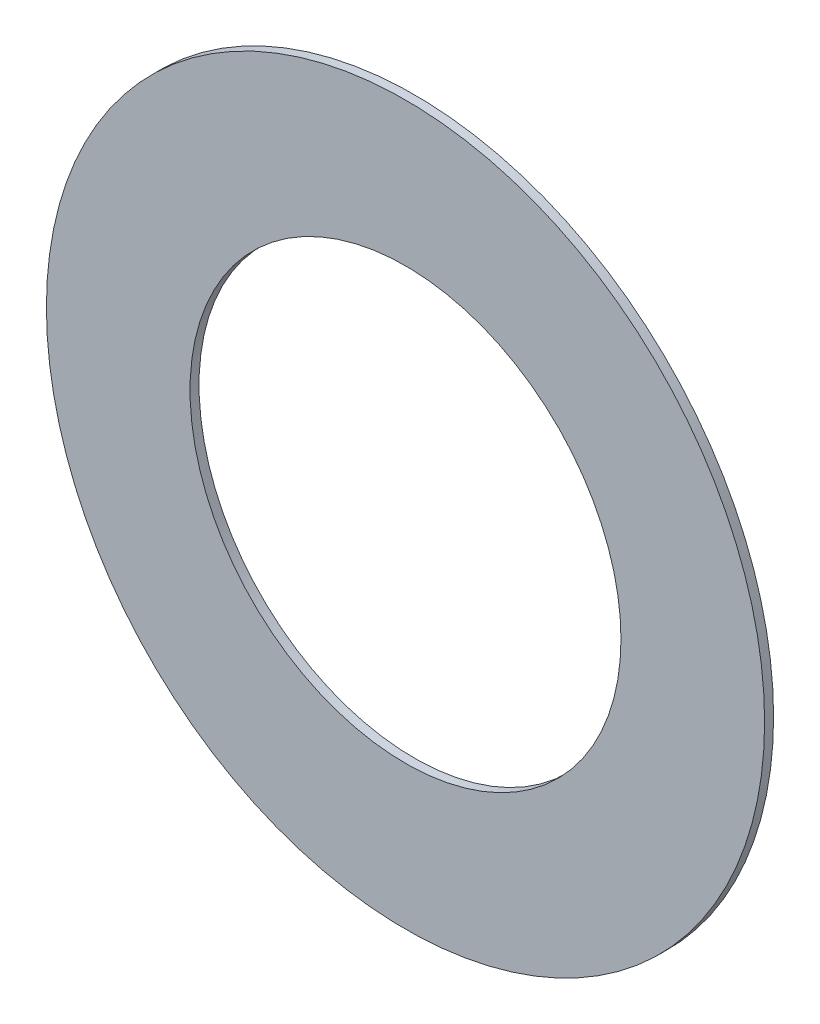
ISO-10303-21;
HEADER;
FILE_DESCRIPTION(('STEP AP214'),'2;1');
FILE_NAME('part.step','',(''),(''),'','','');
FILE_SCHEMA(('AUTOMOTIVE_DESIGN { 1 0 10303 214 1 1 1 1 }'));
ENDSEC;
DATA;
#1=APPLICATION_CONTEXT('core data for automotive mechanical design processes');
#2=APPLICATION_PROTOCOL_DEFINITION('international standard','automotive_design',2000,#1);
#3=PRODUCT_CONTEXT('',#1,'mechanical');
#4=PRODUCT('Part','Part','',(#3));
#5=PRODUCT_RELATED_PRODUCT_CATEGORY('part','',(#4));
#6=PRODUCT_DEFINITION_FORMATION('','',#4);
#7=PRODUCT_DEFINITION_CONTEXT('part definition',#1,'design');
#8=PRODUCT_DEFINITION('design','',#6,#7);
#9=PRODUCT_DEFINITION_SHAPE('','',#8);
#10=(LENGTH_UNIT() NAMED_UNIT(*) SI_UNIT(.MILLI.,.METRE.));
#11=(NAMED_UNIT(*) PLANE_ANGLE_UNIT() SI_UNIT($,.RADIAN.));
#12=(NAMED_UNIT(*) SI_UNIT($,.STERADIAN.) SOLID_ANGLE_UNIT());
#13=UNCERTAINTY_MEASURE_WITH_UNIT(LENGTH_MEASURE(1.E-05),#10,'distance_accuracy_value','');
#14=(GEOMETRIC_REPRESENTATION_CONTEXT(3) GLOBAL_UNCERTAINTY_ASSIGNED_CONTEXT((#13)) GLOBAL_UNIT_ASSIGNED_CONTEXT((#10,
#11,#12)) REPRESENTATION_CONTEXT('',''));
#15=CARTESIAN_POINT('',(0.,0.,0.));
#16=DIRECTION('',(0.,0.,1.));
#17=DIRECTION('',(1.,0.,0.));
#18=AXIS2_PLACEMENT_3D('',#15,#16,#17);
#19=CARTESIAN_POINT('',(0.,0.,3.175));
#20=DIRECTION('',(0.,0.,1.));
#21=DIRECTION('',(1.,0.,0.));
#22=AXIS2_PLACEMENT_3D('',#19,#20,#21);
#23=PLANE('',#22);
#24=CARTESIAN_POINT('',(0.,0.,3.175));
#25=DIRECTION('',(0.,0.,1.));
#26=DIRECTION('',(1.,0.,0.));
#27=AXIS2_PLACEMENT_3D('',#24,#25,#26);
#28=CIRCLE('',#27,127.);
#29=CARTESIAN_POINT('',(127.,0.,3.175));
#30=VERTEX_POINT('',#29);
#31=EDGE_CURVE('E10',#30,#30,#28,.T.);
#32=ORIENTED_EDGE('',*,*,#31,.T.);
#33=EDGE_LOOP('',(#32));
#34=FACE_BOUND('',#33,.T.);
#35=CARTESIAN_POINT('',(0.,0.,3.175));
#36=DIRECTION('',(0.,0.,1.));
#37=DIRECTION('',(1.,0.,0.));
#38=AXIS2_PLACEMENT_3D('',#35,#36,#37);
#39=CIRCLE('',#38,76.2);
#40=CARTESIAN_POINT('',(76.2,0.,3.175));
#41=VERTEX_POINT('',#40);
#42=EDGE_CURVE('E41',#41,#41,#39,.T.);
#43=ORIENTED_EDGE('',*,*,#42,.F.);
#44=EDGE_LOOP('',(#43));
#45=FACE_BOUND('',#44,.T.);
#46=ADVANCED_FACE('F30',(#34,#45),#23,.T.);
#47=CARTESIAN_POINT('',(0.,0.,0.));
#48=DIRECTION('',(0.,0.,1.));
#49=DIRECTION('',(1.,0.,0.));
#50=AXIS2_PLACEMENT_3D('',#47,#48,#49);
#51=PLANE('',#50);
#52=CARTESIAN_POINT('',(0.,0.,0.));
#53=DIRECTION('',(0.,0.,1.));
#54=DIRECTION('',(1.,0.,0.));
#55=AXIS2_PLACEMENT_3D('',#52,#53,#54);
#56=CIRCLE('',#55,127.);
#57=CARTESIAN_POINT('',(127.,0.,0.));
#58=VERTEX_POINT('',#57);
#59=EDGE_CURVE('E34',#58,#58,#56,.T.);
#60=ORIENTED_EDGE('',*,*,#59,.F.);
#61=EDGE_LOOP('',(#60));
#62=FACE_BOUND('',#61,.T.);
#63=CARTESIAN_POINT('',(0.,0.,0.));
#64=DIRECTION('',(0.,0.,1.));
#65=DIRECTION('',(1.,0.,0.));
#66=AXIS2_PLACEMENT_3D('',#63,#64,#65);
#67=CIRCLE('',#66,76.2);
#68=CARTESIAN_POINT('',(76.2,0.,0.));
#69=VERTEX_POINT('',#68);
#70=EDGE_CURVE('E43',#69,#69,#67,.T.);
#71=ORIENTED_EDGE('',*,*,#70,.T.);
#72=EDGE_LOOP('',(#71));
#73=FACE_BOUND('',#72,.T.);
#74=ADVANCED_FACE('F53',(#62,#73),#51,.F.);
#75=CARTESIAN_POINT('',(0.,0.,3.175));
#76=DIRECTION('',(0.,0.,-1.));
#77=DIRECTION('',(-1.,0.,0.));
#78=AXIS2_PLACEMENT_3D('',#75,#76,#77);
#79=CYLINDRICAL_SURFACE('',#78,127.);
#80=ORIENTED_EDGE('',*,*,#31,.F.);
#81=EDGE_LOOP('',(#80));
#82=FACE_BOUND('',#81,.T.);
#83=ORIENTED_EDGE('',*,*,#59,.T.);
#84=EDGE_LOOP('',(#83));
#85=FACE_BOUND('',#84,.T.);
#86=ADVANCED_FACE('F32',(#82,#85),#79,.T.);
#87=CARTESIAN_POINT('',(0.,0.,3.175));
#88=DIRECTION('',(0.,0.,-1.));
#89=DIRECTION('',(-1.,0.,0.));
#90=AXIS2_PLACEMENT_3D('',#87,#88,#89);
#91=CYLINDRICAL_SURFACE('',#90,76.2);
#92=ORIENTED_EDGE('',*,*,#42,.T.);
#93=EDGE_LOOP('',(#92));
#94=FACE_BOUND('',#93,.T.);
#95=ORIENTED_EDGE('',*,*,#70,.F.);
#96=EDGE_LOOP('',(#95));
#97=FACE_BOUND('',#96,.T.);
#98=ADVANCED_FACE('F49',(#94,#97),#91,.F.);
#99=CLOSED_SHELL('',(#46,#74,#86,#98));
#100=MANIFOLD_SOLID_BREP('B2',#99);
#101=ADVANCED_BREP_SHAPE_REPRESENTATION('',(#18,#100),#14);
#102=SHAPE_DEFINITION_REPRESENTATION(#9,#101);
ENDSEC;
END-ISO-10303-21;
